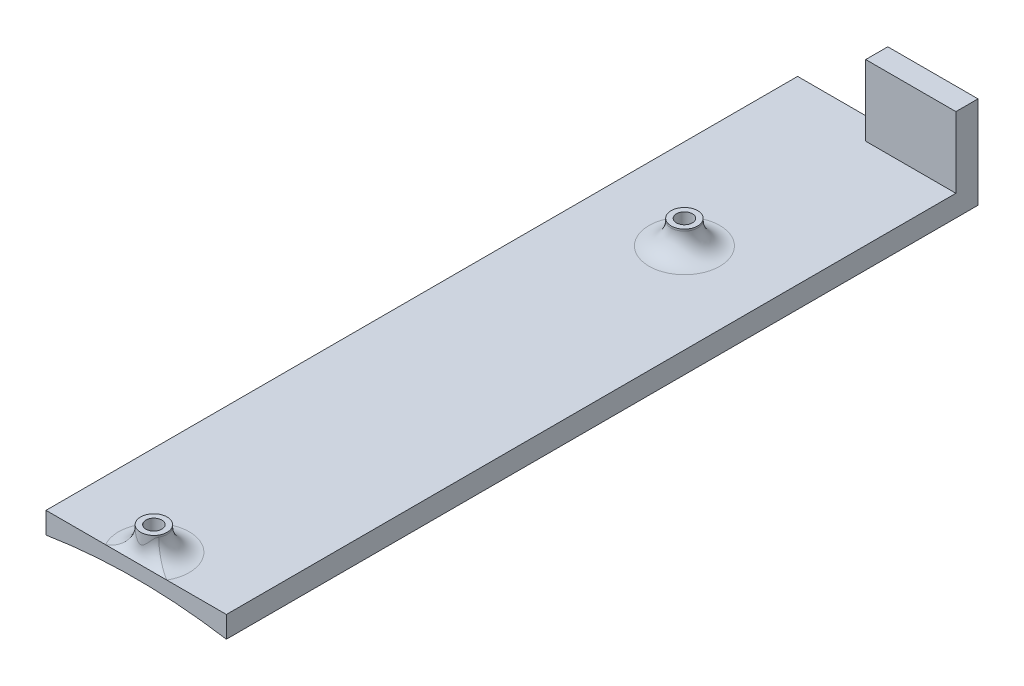
ISO-10303-21;
HEADER;
FILE_DESCRIPTION(('STEP AP214'),'2;1');
FILE_NAME('part.step','',(''),(''),'','','');
FILE_SCHEMA(('AUTOMOTIVE_DESIGN { 1 0 10303 214 1 1 1 1 }'));
ENDSEC;
DATA;
#1=APPLICATION_CONTEXT('core data for automotive mechanical design processes');
#2=APPLICATION_PROTOCOL_DEFINITION('international standard','automotive_design',2000,#1);
#3=PRODUCT_CONTEXT('',#1,'mechanical');
#4=PRODUCT('Part','Part','',(#3));
#5=PRODUCT_RELATED_PRODUCT_CATEGORY('part','',(#4));
#6=PRODUCT_DEFINITION_FORMATION('','',#4);
#7=PRODUCT_DEFINITION_CONTEXT('part definition',#1,'design');
#8=PRODUCT_DEFINITION('design','',#6,#7);
#9=PRODUCT_DEFINITION_SHAPE('','',#8);
#10=(LENGTH_UNIT() NAMED_UNIT(*) SI_UNIT(.MILLI.,.METRE.));
#11=(NAMED_UNIT(*) PLANE_ANGLE_UNIT() SI_UNIT($,.RADIAN.));
#12=(NAMED_UNIT(*) SI_UNIT($,.STERADIAN.) SOLID_ANGLE_UNIT());
#13=UNCERTAINTY_MEASURE_WITH_UNIT(LENGTH_MEASURE(1.E-05),#10,'distance_accuracy_value','');
#14=(GEOMETRIC_REPRESENTATION_CONTEXT(3) GLOBAL_UNCERTAINTY_ASSIGNED_CONTEXT((#13)) GLOBAL_UNIT_ASSIGNED_CONTEXT((#10,
#11,#12)) REPRESENTATION_CONTEXT('',''));
#15=CARTESIAN_POINT('',(0.,0.,0.));
#16=DIRECTION('',(0.,0.,1.));
#17=DIRECTION('',(1.,0.,0.));
#18=AXIS2_PLACEMENT_3D('',#15,#16,#17);
#19=CARTESIAN_POINT('',(0.,0.,21.6986827735627));
#20=DIRECTION('',(1.,0.,0.));
#21=DIRECTION('',(0.,1.,0.));
#22=AXIS2_PLACEMENT_3D('',#19,#20,#21);
#23=PLANE('',#22);
#24=DIRECTION('',(0.,0.,1.));
#25=VECTOR('',#24,1.);
#26=CARTESIAN_POINT('',(0.,-3.81000000000001,0.));
#27=LINE('',#26,#25);
#28=CARTESIAN_POINT('',(0.,-3.81000000000001,0.));
#29=VERTEX_POINT('',#28);
#30=CARTESIAN_POINT('',(0.,-3.81000000000001,3.175));
#31=VERTEX_POINT('',#30);
#32=EDGE_CURVE('E140',#29,#31,#27,.T.);
#33=ORIENTED_EDGE('',*,*,#32,.T.);
#34=DIRECTION('',(0.,1.,0.));
#35=VECTOR('',#34,1.);
#36=CARTESIAN_POINT('',(0.,0.,3.175));
#37=LINE('',#36,#35);
#38=CARTESIAN_POINT('',(0.,6.34999999999999,3.175));
#39=VERTEX_POINT('',#38);
#40=EDGE_CURVE('E72',#31,#39,#37,.T.);
#41=ORIENTED_EDGE('',*,*,#40,.T.);
#42=DIRECTION('',(0.,0.,-1.));
#43=VECTOR('',#42,1.);
#44=CARTESIAN_POINT('',(0.,6.34999999999999,21.6986827735627));
#45=LINE('',#44,#43);
#46=CARTESIAN_POINT('',(0.,6.34999999999999,0.));
#47=VERTEX_POINT('',#46);
#48=EDGE_CURVE('E151',#39,#47,#45,.T.);
#49=ORIENTED_EDGE('',*,*,#48,.T.);
#50=DIRECTION('',(0.,-1.,0.));
#51=VECTOR('',#50,1.);
#52=CARTESIAN_POINT('',(0.,0.,0.));
#53=LINE('',#52,#51);
#54=EDGE_CURVE('E67',#47,#29,#53,.T.);
#55=ORIENTED_EDGE('',*,*,#54,.T.);
#56=EDGE_LOOP('',(#33,#41,#49,#55));
#57=FACE_BOUND('',#56,.T.);
#58=ADVANCED_FACE('F41',(#57),#23,.F.);
#59=CARTESIAN_POINT('',(-12.9539999999999,-6.89087261080565,107.95));
#60=DIRECTION('',(1.,0.,0.));
#61=DIRECTION('',(0.,0.,-1.));
#62=AXIS2_PLACEMENT_3D('',#59,#60,#61);
#63=PLANE('',#62);
#64=DIRECTION('',(0.,0.,-1.));
#65=VECTOR('',#64,1.);
#66=CARTESIAN_POINT('',(-12.9539999999999,-3.81,107.95));
#67=LINE('',#66,#65);
#68=CARTESIAN_POINT('',(-12.9539999999999,-3.81,107.95));
#69=VERTEX_POINT('',#68);
#70=CARTESIAN_POINT('',(-12.9539999999999,-3.81000000000001,0.));
#71=VERTEX_POINT('',#70);
#72=EDGE_CURVE('E123',#69,#71,#67,.T.);
#73=ORIENTED_EDGE('',*,*,#72,.T.);
#74=DIRECTION('',(0.,1.,0.));
#75=VECTOR('',#74,1.);
#76=CARTESIAN_POINT('',(-12.954,-6.89087261080566,0.));
#77=LINE('',#76,#75);
#78=CARTESIAN_POINT('',(-12.954,-6.89087261080566,0.));
#79=VERTEX_POINT('',#78);
#80=EDGE_CURVE('E128',#79,#71,#77,.T.);
#81=ORIENTED_EDGE('',*,*,#80,.F.);
#82=DIRECTION('',(0.,0.,-1.));
#83=VECTOR('',#82,1.);
#84=CARTESIAN_POINT('',(-12.954,-6.89087261080566,107.95));
#85=LINE('',#84,#83);
#86=CARTESIAN_POINT('',(-12.954,-6.89087261080566,107.95));
#87=VERTEX_POINT('',#86);
#88=EDGE_CURVE('E204',#87,#79,#85,.T.);
#89=ORIENTED_EDGE('',*,*,#88,.F.);
#90=DIRECTION('',(0.,-1.,0.));
#91=VECTOR('',#90,1.);
#92=CARTESIAN_POINT('',(-12.9539999999999,-6.89087261080565,107.95));
#93=LINE('',#92,#91);
#94=EDGE_CURVE('E130',#69,#87,#93,.T.);
#95=ORIENTED_EDGE('',*,*,#94,.F.);
#96=EDGE_LOOP('',(#73,#81,#89,#95));
#97=FACE_BOUND('',#96,.T.);
#98=ADVANCED_FACE('F125',(#97),#63,.F.);
#99=CARTESIAN_POINT('',(-12.9539999999999,-3.81,107.95));
#100=DIRECTION('',(0.,-1.,0.));
#101=DIRECTION('',(1.,0.,0.));
#102=AXIS2_PLACEMENT_3D('',#99,#100,#101);
#103=PLANE('',#102);
#104=CARTESIAN_POINT('',(0.,-3.81000000000001,29.21));
#105=DIRECTION('',(0.,-1.,0.));
#106=DIRECTION('',(1.,0.,0.));
#107=AXIS2_PLACEMENT_3D('',#104,#105,#106);
#108=CIRCLE('',#107,5.08);
#109=CARTESIAN_POINT('',(5.08,-3.81000000000001,29.21));
#110=VERTEX_POINT('',#109);
#111=EDGE_CURVE('E211',#110,#110,#108,.T.);
#112=ORIENTED_EDGE('',*,*,#111,.T.);
#113=EDGE_LOOP('',(#112));
#114=FACE_BOUND('',#113,.T.);
#115=DIRECTION('',(1.,0.,0.));
#116=VECTOR('',#115,1.);
#117=CARTESIAN_POINT('',(-12.9539999999999,-3.81000000000001,3.175));
#118=LINE('',#117,#116);
#119=CARTESIAN_POINT('',(12.9540000000001,-3.81000000000001,3.175));
#120=VERTEX_POINT('',#119);
#121=EDGE_CURVE('E154',#31,#120,#118,.T.);
#122=ORIENTED_EDGE('',*,*,#121,.F.);
#123=ORIENTED_EDGE('',*,*,#32,.F.);
#124=DIRECTION('',(1.,0.,0.));
#125=VECTOR('',#124,1.);
#126=CARTESIAN_POINT('',(-12.9539999999999,-3.81000000000001,0.));
#127=LINE('',#126,#125);
#128=EDGE_CURVE('E137',#71,#29,#127,.T.);
#129=ORIENTED_EDGE('',*,*,#128,.F.);
#130=ORIENTED_EDGE('',*,*,#72,.F.);
#131=DIRECTION('',(-1.,0.,0.));
#132=VECTOR('',#131,1.);
#133=CARTESIAN_POINT('',(-12.9539999999999,-3.81,107.95));
#134=LINE('',#133,#132);
#135=CARTESIAN_POINT('',(-4.39940905122497,-3.81,107.95));
#136=VERTEX_POINT('',#135);
#137=EDGE_CURVE('E193',#136,#69,#134,.T.);
#138=ORIENTED_EDGE('',*,*,#137,.F.);
#139=CARTESIAN_POINT('',(0.,-3.81000000000001,105.41));
#140=DIRECTION('',(0.,-1.,0.));
#141=DIRECTION('',(1.,0.,0.));
#142=AXIS2_PLACEMENT_3D('',#139,#140,#141);
#143=CIRCLE('',#142,5.08000000000001);
#144=CARTESIAN_POINT('',(4.39940905122496,-3.81000000000001,107.95));
#145=VERTEX_POINT('',#144);
#146=EDGE_CURVE('E209',#136,#145,#143,.T.);
#147=ORIENTED_EDGE('',*,*,#146,.T.);
#148=CARTESIAN_POINT('',(12.9540000000001,-3.81000000000001,107.95));
#149=VERTEX_POINT('',#148);
#150=EDGE_CURVE('E134',#149,#145,#134,.T.);
#151=ORIENTED_EDGE('',*,*,#150,.F.);
#152=DIRECTION('',(0.,0.,-1.));
#153=VECTOR('',#152,1.);
#154=CARTESIAN_POINT('',(12.9540000000001,-3.81000000000001,107.95));
#155=LINE('',#154,#153);
#156=EDGE_CURVE('E133',#149,#120,#155,.T.);
#157=ORIENTED_EDGE('',*,*,#156,.T.);
#158=EDGE_LOOP('',(#122,#123,#129,#130,#138,#147,#151,#157));
#159=FACE_BOUND('',#158,.T.);
#160=ADVANCED_FACE('F139',(#114,#159),#103,.F.);
#161=CARTESIAN_POINT('',(0.,-86.36,107.95));
#162=DIRECTION('',(0.,0.,-1.));
#163=DIRECTION('',(-1.,0.,0.));
#164=AXIS2_PLACEMENT_3D('',#161,#162,#163);
#165=CYLINDRICAL_SURFACE('',#164,80.518);
#166=ORIENTED_EDGE('',*,*,#88,.T.);
#167=CARTESIAN_POINT('',(0.,-86.36,0.));
#168=DIRECTION('',(0.,0.,-1.));
#169=DIRECTION('',(1.,0.,0.));
#170=AXIS2_PLACEMENT_3D('',#167,#168,#169);
#171=CIRCLE('',#170,80.518);
#172=CARTESIAN_POINT('',(12.954,-6.89087261080566,0.));
#173=VERTEX_POINT('',#172);
#174=EDGE_CURVE('E146',#79,#173,#171,.T.);
#175=ORIENTED_EDGE('',*,*,#174,.T.);
#176=DIRECTION('',(0.,0.,-1.));
#177=VECTOR('',#176,1.);
#178=CARTESIAN_POINT('',(12.954,-6.89087261080566,107.95));
#179=LINE('',#178,#177);
#180=CARTESIAN_POINT('',(12.954,-6.89087261080566,107.95));
#181=VERTEX_POINT('',#180);
#182=EDGE_CURVE('E201',#181,#173,#179,.T.);
#183=ORIENTED_EDGE('',*,*,#182,.F.);
#184=CARTESIAN_POINT('',(0.,-86.36,107.95));
#185=DIRECTION('',(0.,0.,-1.));
#186=DIRECTION('',(1.,0.,0.));
#187=AXIS2_PLACEMENT_3D('',#184,#185,#186);
#188=CIRCLE('',#187,80.518);
#189=EDGE_CURVE('E188',#87,#181,#188,.T.);
#190=ORIENTED_EDGE('',*,*,#189,.F.);
#191=EDGE_LOOP('',(#166,#175,#183,#190));
#192=FACE_BOUND('',#191,.T.);
#193=ADVANCED_FACE('F278',(#192),#165,.F.);
#194=CARTESIAN_POINT('',(12.954,-6.89087261080566,107.95));
#195=DIRECTION('',(-1.,0.,0.));
#196=DIRECTION('',(0.,-1.,0.));
#197=AXIS2_PLACEMENT_3D('',#194,#195,#196);
#198=PLANE('',#197);
#199=DIRECTION('',(0.,1.,0.));
#200=VECTOR('',#199,1.);
#201=CARTESIAN_POINT('',(12.954,-6.89087261080566,0.));
#202=LINE('',#201,#200);
#203=CARTESIAN_POINT('',(12.954,6.35,0.));
#204=VERTEX_POINT('',#203);
#205=EDGE_CURVE('E189',#173,#204,#202,.T.);
#206=ORIENTED_EDGE('',*,*,#205,.T.);
#207=DIRECTION('',(0.,0.,-1.));
#208=VECTOR('',#207,1.);
#209=CARTESIAN_POINT('',(12.954,6.35,0.));
#210=LINE('',#209,#208);
#211=CARTESIAN_POINT('',(12.954,6.35,3.175));
#212=VERTEX_POINT('',#211);
#213=EDGE_CURVE('E157',#212,#204,#210,.T.);
#214=ORIENTED_EDGE('',*,*,#213,.F.);
#215=DIRECTION('',(0.,-1.,0.));
#216=VECTOR('',#215,1.);
#217=CARTESIAN_POINT('',(12.954,6.35,3.175));
#218=LINE('',#217,#216);
#219=EDGE_CURVE('E163',#212,#120,#218,.T.);
#220=ORIENTED_EDGE('',*,*,#219,.T.);
#221=ORIENTED_EDGE('',*,*,#156,.F.);
#222=DIRECTION('',(0.,1.,0.));
#223=VECTOR('',#222,1.);
#224=CARTESIAN_POINT('',(12.954,-6.89087261080566,107.95));
#225=LINE('',#224,#223);
#226=EDGE_CURVE('E191',#181,#149,#225,.T.);
#227=ORIENTED_EDGE('',*,*,#226,.F.);
#228=ORIENTED_EDGE('',*,*,#182,.T.);
#229=EDGE_LOOP('',(#206,#214,#220,#221,#227,#228));
#230=FACE_BOUND('',#229,.T.);
#231=ADVANCED_FACE('F346',(#230),#198,.F.);
#232=CARTESIAN_POINT('',(0.,-86.36,107.95));
#233=DIRECTION('',(0.,0.,1.));
#234=DIRECTION('',(1.,0.,0.));
#235=AXIS2_PLACEMENT_3D('',#232,#233,#234);
#236=PLANE('',#235);
#237=ORIENTED_EDGE('',*,*,#94,.T.);
#238=ORIENTED_EDGE('',*,*,#189,.T.);
#239=ORIENTED_EDGE('',*,*,#226,.T.);
#240=ORIENTED_EDGE('',*,*,#150,.T.);
#241=EDGE_CURVE('E196',#145,#136,#134,.T.);
#242=ORIENTED_EDGE('',*,*,#241,.T.);
#243=ORIENTED_EDGE('',*,*,#137,.T.);
#244=EDGE_LOOP('',(#237,#238,#239,#240,#242,#243));
#245=FACE_BOUND('',#244,.T.);
#246=ADVANCED_FACE('F240',(#245),#236,.T.);
#247=CARTESIAN_POINT('',(0.,-86.36,0.));
#248=DIRECTION('',(0.,0.,1.));
#249=DIRECTION('',(1.,0.,0.));
#250=AXIS2_PLACEMENT_3D('',#247,#248,#249);
#251=PLANE('',#250);
#252=ORIENTED_EDGE('',*,*,#174,.F.);
#253=ORIENTED_EDGE('',*,*,#80,.T.);
#254=ORIENTED_EDGE('',*,*,#128,.T.);
#255=ORIENTED_EDGE('',*,*,#54,.F.);
#256=DIRECTION('',(-1.,0.,0.));
#257=VECTOR('',#256,1.);
#258=CARTESIAN_POINT('',(-12.9539999999999,6.34999999999999,0.));
#259=LINE('',#258,#257);
#260=EDGE_CURVE('E160',#204,#47,#259,.T.);
#261=ORIENTED_EDGE('',*,*,#260,.F.);
#262=ORIENTED_EDGE('',*,*,#205,.F.);
#263=EDGE_LOOP('',(#252,#253,#254,#255,#261,#262));
#264=FACE_BOUND('',#263,.T.);
#265=ADVANCED_FACE('F144',(#264),#251,.F.);
#266=CARTESIAN_POINT('',(0.,-0.381000000000005,105.41));
#267=DIRECTION('',(0.,1.,0.));
#268=DIRECTION('',(0.,0.,1.));
#269=AXIS2_PLACEMENT_3D('',#266,#267,#268);
#270=PLANE('',#269);
#271=CARTESIAN_POINT('',(0.,-0.381000000000005,105.41));
#272=DIRECTION('',(0.,1.,0.));
#273=DIRECTION('',(0.,0.,1.));
#274=AXIS2_PLACEMENT_3D('',#271,#272,#273);
#275=CIRCLE('',#274,1.90500000000001);
#276=CARTESIAN_POINT('',(0.,-0.381000000000005,107.315));
#277=VERTEX_POINT('',#276);
#278=EDGE_CURVE('E182',#277,#277,#275,.T.);
#279=ORIENTED_EDGE('',*,*,#278,.T.);
#280=EDGE_LOOP('',(#279));
#281=FACE_BOUND('',#280,.T.);
#282=CARTESIAN_POINT('',(0.,-0.381000000000005,105.41));
#283=DIRECTION('',(0.,1.,0.));
#284=DIRECTION('',(0.,0.,1.));
#285=AXIS2_PLACEMENT_3D('',#282,#283,#284);
#286=CIRCLE('',#285,1.14300000000001);
#287=CARTESIAN_POINT('',(0.,-0.381000000000005,106.553));
#288=VERTEX_POINT('',#287);
#289=EDGE_CURVE('E179',#288,#288,#286,.T.);
#290=ORIENTED_EDGE('',*,*,#289,.F.);
#291=EDGE_LOOP('',(#290));
#292=FACE_BOUND('',#291,.T.);
#293=ADVANCED_FACE('F256',(#281,#292),#270,.T.);
#294=CARTESIAN_POINT('',(0.,-0.381000000000005,105.41));
#295=DIRECTION('',(0.,-1.,0.));
#296=DIRECTION('',(0.,0.,-1.));
#297=AXIS2_PLACEMENT_3D('',#294,#295,#296);
#298=CYLINDRICAL_SURFACE('',#297,1.90500000000001);
#299=CARTESIAN_POINT('',(0.,-0.635000000000007,105.41));
#300=DIRECTION('',(0.,-1.,0.));
#301=DIRECTION('',(1.,0.,0.));
#302=AXIS2_PLACEMENT_3D('',#299,#300,#301);
#303=CIRCLE('',#302,1.90500000000001);
#304=CARTESIAN_POINT('',(1.64977839420936,-0.635000000000008,106.3625));
#305=VERTEX_POINT('',#304);
#306=CARTESIAN_POINT('',(-1.64977839420936,-0.635000000000006,106.3625));
#307=VERTEX_POINT('',#306);
#308=EDGE_CURVE('E59',#305,#307,#303,.F.);
#309=ORIENTED_EDGE('',*,*,#308,.T.);
#310=CARTESIAN_POINT('',(-1.6721667307497,-0.636781141795463,106.322624470729));
#311=CARTESIAN_POINT('',(-1.62672221265177,-3.86174319014195,106.40589071407));
#312=CARTESIAN_POINT('',(-4.45911128199917,-3.81,107.95));
#313=CARTESIAN_POINT('',(-1.6426378772542,-0.631933074373427,106.376801824383));
#314=CARTESIAN_POINT('',(-1.6581385834826,-3.79399145201548,106.34183119343));
#315=CARTESIAN_POINT('',(-4.38036767267771,-3.81,107.95));
#316=CARTESIAN_POINT('',(-1.61045257029352,-0.637097567066024,106.429446827609));
#317=CARTESIAN_POINT('',(-1.68880160248517,-3.71933595294472,106.299689223068));
#318=CARTESIAN_POINT('',(-4.29454018744931,-3.81,107.95));
#319=CARTESIAN_POINT('',(-1.54167862987858,-0.663935327663639,106.530686228705));
#320=CARTESIAN_POINT('',(-1.73878159048373,-3.57046595957785,106.254383468216));
#321=CARTESIAN_POINT('',(-4.1111430130096,-3.81,107.95));
#322=CARTESIAN_POINT('',(-1.50511909939597,-0.685504093832294,106.579304115463));
#323=CARTESIAN_POINT('',(-1.7583474954536,-3.49652620564305,106.250119818719));
#324=CARTESIAN_POINT('',(-4.01365093172268,-3.81,107.95));
#325=CARTESIAN_POINT('',(-1.40652140528111,-0.757407581800887,106.698256693042));
#326=CARTESIAN_POINT('',(-1.78478251676544,-3.32234496053901,106.277710531567));
#327=CARTESIAN_POINT('',(-3.75072374741607,-3.81,107.95));
#328=CARTESIAN_POINT('',(-1.34169365236754,-0.817091235243672,106.765477937348));
#329=CARTESIAN_POINT('',(-1.78010537994981,-3.22801272566746,106.32901816598));
#330=CARTESIAN_POINT('',(-3.57784973964593,-3.81,107.95));
#331=CARTESIAN_POINT('',(-1.20453374850763,-0.956340623773255,106.888746194415));
#332=CARTESIAN_POINT('',(-1.72201308757156,-3.07958191774923,106.464790659879));
#333=CARTESIAN_POINT('',(-3.21208999602116,-3.81,107.95));
#334=CARTESIAN_POINT('',(-1.13216969568859,-1.03599306868141,106.94474250562));
#335=CARTESIAN_POINT('',(-1.67018877285162,-3.02393928713444,106.548286365923));
#336=CARTESIAN_POINT('',(-3.01911918850605,-3.81,107.95));
#337=CARTESIAN_POINT('',(-0.979088929168684,-1.20670905368073,107.046801943812));
#338=CARTESIAN_POINT('',(-1.5234502826278,-2.94719886752978,106.721425707388));
#339=CARTESIAN_POINT('',(-2.61090381111323,-3.81,107.95));
#340=CARTESIAN_POINT('',(-0.898191153766391,-1.2980360258347,107.092530888712));
#341=CARTESIAN_POINT('',(-1.42834220321079,-2.92565420382507,106.811568641812));
#342=CARTESIAN_POINT('',(-2.39517641003139,-3.81,107.95));
#343=CARTESIAN_POINT('',(-0.772280670179447,-1.43251870609355,107.15205534709));
#344=CARTESIAN_POINT('',(-1.25924154435489,-2.91200697117103,106.936668204781));
#345=CARTESIAN_POINT('',(-2.05941512048467,-3.81,107.95));
#346=CARTESIAN_POINT('',(-0.729545985912474,-1.47693202907554,107.17038653098));
#347=CARTESIAN_POINT('',(-1.19907613407569,-2.91047401962154,106.976438734011));
#348=CARTESIAN_POINT('',(-1.94545596245091,-3.81,107.95));
#349=CARTESIAN_POINT('',(-0.642518603547036,-1.56296912930079,107.203982437055));
#350=CARTESIAN_POINT('',(-1.07136634960724,-2.91168679846818,107.050988824646));
#351=CARTESIAN_POINT('',(-1.71338294280331,-3.81,107.95));
#352=CARTESIAN_POINT('',(-0.598226303321815,-1.60459361113846,107.219247935741));
#353=CARTESIAN_POINT('',(-1.00379055456577,-2.91438306891922,107.085896662835));
#354=CARTESIAN_POINT('',(-1.59527014218478,-3.81,107.95));
#355=CARTESIAN_POINT('',(-0.485296610062094,-1.70249288969612,107.253509334112));
#356=CARTESIAN_POINT('',(-0.826771116847523,-2.92414327469882,107.165192092062));
#357=CARTESIAN_POINT('',(-1.29412429350901,-3.81,107.95));
#358=CARTESIAN_POINT('',(-0.41561910813807,-1.75560660857147,107.27051982188));
#359=CARTESIAN_POINT('',(-0.712490724412666,-2.93271658465898,107.206149139234));
#360=CARTESIAN_POINT('',(-1.1083176217774,-3.81000000000001,107.95));
#361=CARTESIAN_POINT('',(-0.308829813308879,-1.81950609474379,107.290147536739));
#362=CARTESIAN_POINT('',(-0.532873954867028,-2.94466210805277,107.25382603379));
#363=CARTESIAN_POINT('',(-0.823546168869155,-3.81000000000001,107.95));
#364=CARTESIAN_POINT('',(-0.272904035988847,-1.83816296537389,107.29570526032));
#365=CARTESIAN_POINT('',(-0.471828969012712,-2.94848353115007,107.267426799026));
#366=CARTESIAN_POINT('',(-0.727744095984212,-3.81000000000001,107.95));
#367=CARTESIAN_POINT('',(-0.200421401257377,-1.86909139612613,107.304779236708));
#368=CARTESIAN_POINT('',(-0.347754616378425,-2.95507682484346,107.289694684979));
#369=CARTESIAN_POINT('',(-0.534457070009536,-3.81000000000001,107.95));
#370=CARTESIAN_POINT('',(-0.163864930008816,-1.88136672955633,107.308296696037));
#371=CARTESIAN_POINT('',(-0.284645720477662,-2.95785725808991,107.298395939584));
#372=CARTESIAN_POINT('',(-0.436973146687453,-3.81000000000001,107.95));
#373=CARTESIAN_POINT('',(-0.0899570571916948,-1.89872264373107,107.313239119362));
#374=CARTESIAN_POINT('',(-0.156606116966008,-2.96184069330533,107.310622359969));
#375=CARTESIAN_POINT('',(-0.239885485847286,-3.81000000000001,107.95));
#376=CARTESIAN_POINT('',(-0.0526013353932421,-1.90372215973685,107.314640513228));
#377=CARTESIAN_POINT('',(-0.0915669922487007,-2.96303177591255,107.314107811576));
#378=CARTESIAN_POINT('',(-0.140270227716055,-3.81000000000001,107.95));
#379=CARTESIAN_POINT('',(0.0221581877923277,-1.90584541863746,107.315237859472));
#380=CARTESIAN_POINT('',(0.0385609629344973,-2.9635327566232,107.315590224287));
#381=CARTESIAN_POINT('',(0.0590885007802838,-3.81000000000001,107.95));
#382=CARTESIAN_POINT('',(0.0595619870204116,-1.90296950364097,107.314433907649));
#383=CARTESIAN_POINT('',(0.103750270299668,-2.96284351665257,107.313589716159));
#384=CARTESIAN_POINT('',(0.158831965387969,-3.81000000000001,107.95));
#385=CARTESIAN_POINT('',(0.134143791226946,-1.88957377704065,107.310638769483));
#386=CARTESIAN_POINT('',(0.233217704341419,-2.95973229571332,107.304188010076));
#387=CARTESIAN_POINT('',(0.357716776604986,-3.81000000000001,107.95));
#388=CARTESIAN_POINT('',(0.171321123490097,-1.87903726194991,107.307642803492));
#389=CARTESIAN_POINT('',(0.297591342923249,-2.95730183173107,107.296760597189));
#390=CARTESIAN_POINT('',(0.456856329306856,-3.81000000000001,107.95));
#391=CARTESIAN_POINT('',(0.245071550784232,-1.85114005519225,107.299535188327));
#392=CARTESIAN_POINT('',(0.424328565569755,-2.95120773207034,107.276816760704));
#393=CARTESIAN_POINT('',(0.653524135425803,-3.81000000000001,107.95));
#394=CARTESIAN_POINT('',(0.281644501044933,-1.83377775251343,107.294423039679));
#395=CARTESIAN_POINT('',(0.486779217673829,-2.94753580895551,107.264269967243));
#396=CARTESIAN_POINT('',(0.751052002788792,-3.81000000000001,107.95));
#397=CARTESIAN_POINT('',(0.410335899595679,-1.76197687548871,107.272645140225));
#398=CARTESIAN_POINT('',(0.704664379572565,-2.93355757781501,107.211099581131));
#399=CARTESIAN_POINT('',(1.09422906558258,-3.81000000000001,107.95));
#400=CARTESIAN_POINT('',(0.500335031580809,-1.69188412568509,107.250379193439));
#401=CARTESIAN_POINT('',(0.852567890893547,-2.92184531255282,107.157106922246));
#402=CARTESIAN_POINT('',(1.33422675084797,-3.81000000000001,107.95));
#403=CARTESIAN_POINT('',(0.630692405949074,-1.57432567338336,107.208154040705));
#404=CARTESIAN_POINT('',(1.05337735904978,-2.91240650717113,107.060598440984));
#405=CARTESIAN_POINT('',(1.68184641588135,-3.81000000000001,107.95));
#406=CARTESIAN_POINT('',(0.673449609267601,-1.53297741058787,107.192569143672));
#407=CARTESIAN_POINT('',(1.1174976764659,-2.9106259877229,107.025354537389));
#408=CARTESIAN_POINT('',(1.79586562476366,-3.81000000000001,107.95));
#409=CARTESIAN_POINT('',(0.757490211399576,-1.44807850812966,107.158508769854));
#410=CARTESIAN_POINT('',(1.23850767634215,-2.91139969181848,106.950696416211));
#411=CARTESIAN_POINT('',(2.01997389703614,-3.81000000000001,107.95));
#412=CARTESIAN_POINT('',(0.79877381768524,-1.40452818060543,107.140033701972));
#413=CARTESIAN_POINT('',(1.29541925676998,-2.91400601123682,106.911166326001));
#414=CARTESIAN_POINT('',(2.13006351368558,-3.81000000000001,107.95));
#415=CARTESIAN_POINT('',(0.925550235784951,-1.26769186808409,107.077820869673));
#416=CARTESIAN_POINT('',(1.46193379724997,-2.93160447304869,106.782227201281));
#417=CARTESIAN_POINT('',(2.46813396239442,-3.81000000000001,107.95));
#418=CARTESIAN_POINT('',(1.00850676538122,-1.17359353314896,107.029052474708));
#419=CARTESIAN_POINT('',(1.55578940821796,-2.95762924756306,106.688104242801));
#420=CARTESIAN_POINT('',(2.68935137610007,-3.81000000000001,107.95));
#421=CARTESIAN_POINT('',(1.16721983354834,-0.997373538975048,106.918616609226));
#422=CARTESIAN_POINT('',(1.69782287562092,-3.04831926542739,106.508236184115));
#423=CARTESIAN_POINT('',(3.11258622460347,-3.81000000000001,107.95));
#424=CARTESIAN_POINT('',(1.24298894318784,-0.915230829173272,106.856972287519));
#425=CARTESIAN_POINT('',(1.74471873103094,-3.11466315716106,106.422292756421));
#426=CARTESIAN_POINT('',(3.31463718225601,-3.81000000000001,107.95));
#427=CARTESIAN_POINT('',(1.36877305795726,-0.792579540523785,106.737077052416));
#428=CARTESIAN_POINT('',(1.78171729825631,-3.26700610941627,106.30899022678));
#429=CARTESIAN_POINT('',(3.65006148756473,-3.81000000000001,107.95));
#430=CARTESIAN_POINT('',(1.4206226950274,-0.746814206322238,106.681517775712));
#431=CARTESIAN_POINT('',(1.78167910087651,-3.34614274487636,106.273030897672));
#432=CARTESIAN_POINT('',(3.78832718665669,-3.81000000000001,107.95));
#433=CARTESIAN_POINT('',(1.51798362796123,-0.676448534338228,106.563496273659));
#434=CARTESIAN_POINT('',(1.75414292069047,-3.52058325598366,106.247289412378));
#435=CARTESIAN_POINT('',(4.0479563413127,-3.81000000000001,107.95));
#436=CARTESIAN_POINT('',(1.56351527698552,-0.651778846008309,106.501057434631));
#437=CARTESIAN_POINT('',(1.72581677944524,-3.6162022770135,106.258978430489));
#438=CARTESIAN_POINT('',(4.1693740719727,-3.81000000000001,107.95));
#439=CARTESIAN_POINT('',(1.61696553024241,-0.637996122668489,106.417438775093));
#440=CARTESIAN_POINT('',(1.68110670603674,-3.73474434364676,106.313653107523));
#441=CARTESIAN_POINT('',(4.31190808064321,-3.81000000000001,107.95));
#442=CARTESIAN_POINT('',(1.62845945639952,-0.63607148089369,106.398750780679));
#443=CARTESIAN_POINT('',(1.67055882331004,-3.76099351370894,106.328472445445));
#444=CARTESIAN_POINT('',(4.34255855039711,-3.81000000000001,107.95));
#445=CARTESIAN_POINT('',(1.6508035471498,-0.634603743239718,106.360974496926));
#446=CARTESIAN_POINT('',(1.64889383887255,-3.8124243982547,106.363301618492));
#447=CARTESIAN_POINT('',(4.40214279240109,-3.81000000000001,107.95));
#448=CARTESIAN_POINT('',(1.66165353638759,-0.635061293091001,106.341886100449));
#449=CARTESIAN_POINT('',(1.63777921915674,-3.8375796565344,106.383343813134));
#450=CARTESIAN_POINT('',(4.43107609703681,-3.81000000000001,107.95));
#451=CARTESIAN_POINT('',(1.67216904495995,-0.636781520725133,106.322620230478));
#452=CARTESIAN_POINT('',(1.62671976732461,-3.86174853156033,106.405895696701));
#453=CARTESIAN_POINT('',(4.45911745322652,-3.81000000000001,107.95));
#454=(BOUNDED_SURFACE() B_SPLINE_SURFACE(3,2,((#310,#311,#312),(#313,#314,#315),(#316,#317,
#318),(#319,#320,#321),(#322,#323,#324),(#325,#326,#327),(#328,#329,#330),(#331,#332,#333),
(#334,#335,#336),(#337,#338,#339),(#340,#341,#342),(#343,#344,#345),(#346,#347,#348),(#349,#350,
#351),(#352,#353,#354),(#355,#356,#357),(#358,#359,#360),(#361,#362,#363),(#364,#365,#366),
(#367,#368,#369),(#370,#371,#372),(#373,#374,#375),(#376,#377,#378),(#379,#380,#381),(#382,#383,
#384),(#385,#386,#387),(#388,#389,#390),(#391,#392,#393),(#394,#395,#396),(#397,#398,#399),
(#400,#401,#402),(#403,#404,#405),(#406,#407,#408),(#409,#410,#411),(#412,#413,#414),(#415,#416,
#417),(#418,#419,#420),(#421,#422,#423),(#424,#425,#426),(#427,#428,#429),(#430,#431,#432),
(#433,#434,#435),(#436,#437,#438),(#439,#440,#441),(#442,#443,#444),(#445,#446,#447),(#448,#449,
#450),(#451,#452,#453)),.UNSPECIFIED.,.F.,.F.,.F.) B_SPLINE_SURFACE_WITH_KNOTS((4,2,2,2,2,2,2,2,
2,2,2,2,2,2,2,2,2,2,2,2,2,2,2,4),(3,3),(0.,0.492587638547532,0.982063312191497,1.74606779241144,
2.5134490549671,3.30302770045169,3.69788520471238,4.09264256997516,4.68594574509058,
4.98180803777507,5.27749519194155,5.57645221875857,5.87539625908975,6.17499409162082,
6.47466267726329,7.24061570937871,7.62508473835002,8.00949942151156,8.82655487524659,
9.64215384918136,10.2634051110963,10.8826061115217,11.058155430943,11.2337523382416),(0.,1.),
.UNSPECIFIED.) GEOMETRIC_REPRESENTATION_ITEM() RATIONAL_B_SPLINE_SURFACE(((1.,0.701411224298554,
1.),(1.,0.70883993644932,1.),(1.,0.717328011463435,1.),(1.,0.735576447878796,1.),(1.,
0.745328432725857,1.),(1.,0.77099284778507,1.),(1.,0.787292788161053,1.),(1.,0.819122521383074,
1.),(1.,0.83464859187544,1.),(1.,0.864028922951749,1.),(1.,0.877821833513003,1.),(1.,
0.896193876200888,1.),(1.,0.901932065217861,1.),(1.,0.912551502644564,1.),(1.,0.917432968012173,
1.),(1.,0.928466190241666,1.),(1.,0.934022007155246,1.),(1.,0.94046616505741,1.),(1.,
0.942298098151946,1.),(1.,0.945294855290109,1.),(1.,0.946460073593389,1.),(1.,0.948098517150249,
1.),(1.,0.948563947464189,1.),(1.,0.948762268795054,1.),(1.,0.948495191632099,1.),(1.,
0.947236250583026,1.),(1.,0.946242802861932,1.),(1.,0.943562129145571,1.),(1.,0.941874739362832,
1.),(1.,0.934711605036063,1.),(1.,0.927426581253463,1.),(1.,0.913886970936059,1.),(1.,
0.908926261885526,1.),(1.,0.898212958878922,1.),(1.,0.892460476957194,1.),(1.,0.873364829634933,
1.),(1.,0.858765057634236,1.),(1.,0.827356006643319,1.),(1.,0.810550712704411,1.),(1.,
0.780487426178288,1.),(1.,0.767338379957155,1.),(1.,0.741962812807396,1.),(1.,0.729733390560408,
1.),(1.,0.715636414612068,1.),(1.,0.712622760605671,1.),(1.,0.706830872331998,1.),(1.,
0.704052702103718,1.),(1.,0.701410642762945,1.))) REPRESENTATION_ITEM('') SURFACE());
#455=CARTESIAN_POINT('',(-1.6721667307497,-0.636781141795463,106.322624470729));
#456=CARTESIAN_POINT('',(-1.6426378772542,-0.631933074373427,106.376801824383));
#457=CARTESIAN_POINT('',(-1.61045257029352,-0.637097567066024,106.429446827609));
#458=CARTESIAN_POINT('',(-1.54167862987858,-0.663935327663639,106.530686228705));
#459=CARTESIAN_POINT('',(-1.50511909939597,-0.685504093832294,106.579304115463));
#460=CARTESIAN_POINT('',(-1.4065214052811,-0.757407581800887,106.698256693042));
#461=CARTESIAN_POINT('',(-1.34169365236754,-0.817091235243672,106.765477937348));
#462=CARTESIAN_POINT('',(-1.20453374850763,-0.956340623773255,106.888746194415));
#463=CARTESIAN_POINT('',(-1.13216969568859,-1.03599306868141,106.94474250562));
#464=CARTESIAN_POINT('',(-0.979088929168684,-1.20670905368073,107.046801943812));
#465=CARTESIAN_POINT('',(-0.898191153766391,-1.2980360258347,107.092530888712));
#466=CARTESIAN_POINT('',(-0.772280670179447,-1.43251870609355,107.15205534709));
#467=CARTESIAN_POINT('',(-0.729545985912474,-1.47693202907554,107.17038653098));
#468=CARTESIAN_POINT('',(-0.642518603547036,-1.56296912930079,107.203982437055));
#469=CARTESIAN_POINT('',(-0.598226303321815,-1.60459361113846,107.219247935741));
#470=CARTESIAN_POINT('',(-0.485296610062094,-1.70249288969612,107.253509334112));
#471=CARTESIAN_POINT('',(-0.41561910813807,-1.75560660857147,107.27051982188));
#472=CARTESIAN_POINT('',(-0.308829813308879,-1.81950609474379,107.290147536739));
#473=CARTESIAN_POINT('',(-0.272904035988847,-1.83816296537389,107.29570526032));
#474=CARTESIAN_POINT('',(-0.200421401257377,-1.86909139612613,107.304779236708));
#475=CARTESIAN_POINT('',(-0.163864930008816,-1.88136672955633,107.308296696037));
#476=CARTESIAN_POINT('',(-0.0899570571916947,-1.89872264373107,107.313239119362));
#477=CARTESIAN_POINT('',(-0.0526013353932421,-1.90372215973685,107.314640513228));
#478=CARTESIAN_POINT('',(0.0221581877923277,-1.90584541863746,107.315237859472));
#479=CARTESIAN_POINT('',(0.0595619870204116,-1.90296950364097,107.314433907649));
#480=CARTESIAN_POINT('',(0.134143791226946,-1.88957377704065,107.310638769483));
#481=CARTESIAN_POINT('',(0.171321123490097,-1.87903726194991,107.307642803492));
#482=CARTESIAN_POINT('',(0.245071550784232,-1.85114005519225,107.299535188327));
#483=CARTESIAN_POINT('',(0.281644501044933,-1.83377775251343,107.294423039679));
#484=CARTESIAN_POINT('',(0.410335899595679,-1.76197687548871,107.272645140225));
#485=CARTESIAN_POINT('',(0.500335031580809,-1.69188412568509,107.250379193439));
#486=CARTESIAN_POINT('',(0.630692405949074,-1.57432567338336,107.208154040705));
#487=CARTESIAN_POINT('',(0.673449609267601,-1.53297741058787,107.192569143672));
#488=CARTESIAN_POINT('',(0.757490211399576,-1.44807850812966,107.158508769854));
#489=CARTESIAN_POINT('',(0.79877381768524,-1.40452818060543,107.140033701972));
#490=CARTESIAN_POINT('',(0.925550235784951,-1.26769186808409,107.077820869673));
#491=CARTESIAN_POINT('',(1.00850676538122,-1.17359353314896,107.029052474708));
#492=CARTESIAN_POINT('',(1.16721983354834,-0.997373538975048,106.918616609226));
#493=CARTESIAN_POINT('',(1.24298894318784,-0.915230829173272,106.856972287519));
#494=CARTESIAN_POINT('',(1.36877305795726,-0.792579540523785,106.737077052416));
#495=CARTESIAN_POINT('',(1.4206226950274,-0.746814206322238,106.681517775712));
#496=CARTESIAN_POINT('',(1.51798362796123,-0.676448534338228,106.563496273659));
#497=CARTESIAN_POINT('',(1.56351527698552,-0.651778846008308,106.501057434631));
#498=CARTESIAN_POINT('',(1.61696553024241,-0.637996122668489,106.417438775093));
#499=CARTESIAN_POINT('',(1.62845945639952,-0.63607148089369,106.398750780679));
#500=CARTESIAN_POINT('',(1.6508035471498,-0.634603743239719,106.360974496926));
#501=CARTESIAN_POINT('',(1.66165353638759,-0.635061293091001,106.341886100449));
#502=CARTESIAN_POINT('',(1.67216904495995,-0.636781520725133,106.322620230478));
#503=B_SPLINE_CURVE_WITH_KNOTS('',3,(#455,#456,#457,#458,#459,#460,#461,#462,#463,#464,#465,
#466,#467,#468,#469,#470,#471,#472,#473,#474,#475,#476,#477,#478,#479,#480,#481,#482,#483,#484,
#485,#486,#487,#488,#489,#490,#491,#492,#493,#494,#495,#496,#497,#498,#499,#500,#501,#502),
.UNSPECIFIED.,.F.,.F.,(4,2,2,2,2,2,2,2,2,2,2,2,2,2,2,2,2,2,2,2,2,2,2,4),(0.,0.492587638547532,
0.982063312191497,1.74606779241144,2.5134490549671,3.30302770045169,3.69788520471238,
4.09264256997516,4.68594574509058,4.98180803777507,5.27749519194155,5.57645221875857,
5.87539625908975,6.17499409162082,6.47466267726329,7.24061570937871,7.62508473835002,
8.00949942151156,8.82655487524659,9.64215384918136,10.2634051110963,10.8826061115217,
11.058155430943,11.2337523382416),.UNSPECIFIED.);
#504=EDGE_CURVE('E11',#307,#305,#503,.T.);
#505=ORIENTED_EDGE('',*,*,#504,.T.);
#506=EDGE_LOOP('',(#309,#505));
#507=FACE_BOUND('',#506,.T.);
#508=ORIENTED_EDGE('',*,*,#278,.F.);
#509=EDGE_LOOP('',(#508));
#510=FACE_BOUND('',#509,.T.);
#511=ADVANCED_FACE('F221',(#507,#510),#298,.T.);
#512=CARTESIAN_POINT('',(0.,-0.381000000000005,105.41));
#513=DIRECTION('',(0.,-1.,0.));
#514=DIRECTION('',(0.,0.,-1.));
#515=AXIS2_PLACEMENT_3D('',#512,#513,#514);
#516=CYLINDRICAL_SURFACE('',#515,1.14300000000001);
#517=ORIENTED_EDGE('',*,*,#289,.T.);
#518=EDGE_LOOP('',(#517));
#519=FACE_BOUND('',#518,.T.);
#520=CARTESIAN_POINT('',(0.,-3.81000000000001,105.41));
#521=DIRECTION('',(0.,1.,0.));
#522=DIRECTION('',(0.,0.,1.));
#523=AXIS2_PLACEMENT_3D('',#520,#521,#522);
#524=CIRCLE('',#523,1.14300000000001);
#525=CARTESIAN_POINT('',(0.,-3.81000000000001,106.553));
#526=VERTEX_POINT('',#525);
#527=EDGE_CURVE('E176',#526,#526,#524,.T.);
#528=ORIENTED_EDGE('',*,*,#527,.F.);
#529=EDGE_LOOP('',(#528));
#530=FACE_BOUND('',#529,.T.);
#531=ADVANCED_FACE('F255',(#519,#530),#516,.F.);
#532=ORIENTED_EDGE('',*,*,#527,.T.);
#533=EDGE_LOOP('',(#532));
#534=FACE_BOUND('',#533,.T.);
#535=ADVANCED_FACE('F265',(#534),#103,.F.);
#536=CARTESIAN_POINT('',(0.,-0.381000000000005,29.21));
#537=DIRECTION('',(0.,1.,0.));
#538=DIRECTION('',(0.,0.,1.));
#539=AXIS2_PLACEMENT_3D('',#536,#537,#538);
#540=PLANE('',#539);
#541=CARTESIAN_POINT('',(0.,-0.381000000000005,29.21));
#542=DIRECTION('',(0.,1.,0.));
#543=DIRECTION('',(0.,0.,1.));
#544=AXIS2_PLACEMENT_3D('',#541,#542,#543);
#545=CIRCLE('',#544,1.905);
#546=CARTESIAN_POINT('',(0.,-0.381000000000005,31.115));
#547=VERTEX_POINT('',#546);
#548=EDGE_CURVE('E168',#547,#547,#545,.T.);
#549=ORIENTED_EDGE('',*,*,#548,.T.);
#550=EDGE_LOOP('',(#549));
#551=FACE_BOUND('',#550,.T.);
#552=CARTESIAN_POINT('',(0.,-0.381000000000005,29.21));
#553=DIRECTION('',(0.,1.,0.));
#554=DIRECTION('',(0.,0.,1.));
#555=AXIS2_PLACEMENT_3D('',#552,#553,#554);
#556=CIRCLE('',#555,1.143);
#557=CARTESIAN_POINT('',(0.,-0.381000000000005,30.353));
#558=VERTEX_POINT('',#557);
#559=EDGE_CURVE('E171',#558,#558,#556,.T.);
#560=ORIENTED_EDGE('',*,*,#559,.F.);
#561=EDGE_LOOP('',(#560));
#562=FACE_BOUND('',#561,.T.);
#563=ADVANCED_FACE('F270',(#551,#562),#540,.T.);
#564=CARTESIAN_POINT('',(0.,-0.381000000000005,29.21));
#565=DIRECTION('',(0.,-1.,0.));
#566=DIRECTION('',(0.,0.,-1.));
#567=AXIS2_PLACEMENT_3D('',#564,#565,#566);
#568=CYLINDRICAL_SURFACE('',#567,1.905);
#569=CARTESIAN_POINT('',(0.,-0.635000000000007,29.21));
#570=DIRECTION('',(0.,-1.,0.));
#571=DIRECTION('',(1.,0.,0.));
#572=AXIS2_PLACEMENT_3D('',#569,#570,#571);
#573=CIRCLE('',#572,1.905);
#574=CARTESIAN_POINT('',(1.905,-0.635000000000008,29.21));
#575=VERTEX_POINT('',#574);
#576=EDGE_CURVE('E206',#575,#575,#573,.F.);
#577=ORIENTED_EDGE('',*,*,#576,.T.);
#578=EDGE_LOOP('',(#577));
#579=FACE_BOUND('',#578,.T.);
#580=ORIENTED_EDGE('',*,*,#548,.F.);
#581=EDGE_LOOP('',(#580));
#582=FACE_BOUND('',#581,.T.);
#583=ADVANCED_FACE('F274',(#579,#582),#568,.T.);
#584=CARTESIAN_POINT('',(0.,-0.381000000000005,29.21));
#585=DIRECTION('',(0.,-1.,0.));
#586=DIRECTION('',(0.,0.,-1.));
#587=AXIS2_PLACEMENT_3D('',#584,#585,#586);
#588=CYLINDRICAL_SURFACE('',#587,1.143);
#589=ORIENTED_EDGE('',*,*,#559,.T.);
#590=EDGE_LOOP('',(#589));
#591=FACE_BOUND('',#590,.T.);
#592=CARTESIAN_POINT('',(0.,-3.81000000000001,29.21));
#593=DIRECTION('',(0.,1.,0.));
#594=DIRECTION('',(0.,0.,1.));
#595=AXIS2_PLACEMENT_3D('',#592,#593,#594);
#596=CIRCLE('',#595,1.143);
#597=CARTESIAN_POINT('',(0.,-3.81000000000001,30.353));
#598=VERTEX_POINT('',#597);
#599=EDGE_CURVE('E173',#598,#598,#596,.T.);
#600=ORIENTED_EDGE('',*,*,#599,.F.);
#601=EDGE_LOOP('',(#600));
#602=FACE_BOUND('',#601,.T.);
#603=ADVANCED_FACE('F281',(#591,#602),#588,.F.);
#604=ORIENTED_EDGE('',*,*,#599,.T.);
#605=EDGE_LOOP('',(#604));
#606=FACE_BOUND('',#605,.T.);
#607=ADVANCED_FACE('F232',(#606),#103,.F.);
#608=CARTESIAN_POINT('',(0.,-0.635000000000006,29.21));
#609=DIRECTION('',(0.,-1.,0.));
#610=DIRECTION('',(1.,0.,0.));
#611=AXIS2_PLACEMENT_3D('',#608,#609,#610);
#612=TOROIDAL_SURFACE('',#611,5.08,3.175);
#613=ORIENTED_EDGE('',*,*,#111,.F.);
#614=EDGE_LOOP('',(#613));
#615=FACE_BOUND('',#614,.T.);
#616=ORIENTED_EDGE('',*,*,#576,.F.);
#617=EDGE_LOOP('',(#616));
#618=FACE_BOUND('',#617,.T.);
#619=ADVANCED_FACE('F229',(#615,#618),#612,.F.);
#620=CARTESIAN_POINT('',(0.,-0.635000000000006,105.41));
#621=DIRECTION('',(0.,-1.,0.));
#622=DIRECTION('',(1.,0.,0.));
#623=AXIS2_PLACEMENT_3D('',#620,#621,#622);
#624=TOROIDAL_SURFACE('',#623,5.08000000000001,3.175);
#625=CARTESIAN_POINT('',(4.39940905122496,-0.635000000000008,107.95));
#626=DIRECTION('',(0.499999999999997,0.,-0.86602540378444));
#627=DIRECTION('',(-0.86602540378444,0.,-0.499999999999997));
#628=AXIS2_PLACEMENT_3D('',#625,#626,#627);
#629=CIRCLE('',#628,3.175);
#630=EDGE_CURVE('E167',#145,#305,#629,.T.);
#631=ORIENTED_EDGE('',*,*,#630,.F.);
#632=ORIENTED_EDGE('',*,*,#146,.F.);
#633=CARTESIAN_POINT('',(-4.39940905122495,-0.635000000000006,107.95));
#634=DIRECTION('',(-0.500000000000002,0.,-0.866025403784438));
#635=DIRECTION('',(-0.866025403784438,0.,0.500000000000002));
#636=AXIS2_PLACEMENT_3D('',#633,#634,#635);
#637=CIRCLE('',#636,3.175);
#638=EDGE_CURVE('E172',#307,#136,#637,.T.);
#639=ORIENTED_EDGE('',*,*,#638,.F.);
#640=ORIENTED_EDGE('',*,*,#308,.F.);
#641=EDGE_LOOP('',(#631,#632,#639,#640));
#642=FACE_BOUND('',#641,.T.);
#643=ADVANCED_FACE('F231',(#642),#624,.F.);
#644=ORIENTED_EDGE('',*,*,#638,.T.);
#645=ORIENTED_EDGE('',*,*,#241,.F.);
#646=ORIENTED_EDGE('',*,*,#630,.T.);
#647=ORIENTED_EDGE('',*,*,#504,.F.);
#648=EDGE_LOOP('',(#644,#645,#646,#647));
#649=FACE_BOUND('',#648,.T.);
#650=ADVANCED_FACE('F43',(#649),#454,.F.);
#651=CARTESIAN_POINT('',(-12.9539999999999,6.34999999999999,3.175));
#652=DIRECTION('',(0.,0.,-1.));
#653=DIRECTION('',(-1.,0.,0.));
#654=AXIS2_PLACEMENT_3D('',#651,#652,#653);
#655=PLANE('',#654);
#656=DIRECTION('',(1.,0.,0.));
#657=VECTOR('',#656,1.);
#658=CARTESIAN_POINT('',(-12.9539999999999,6.34999999999999,3.175));
#659=LINE('',#658,#657);
#660=EDGE_CURVE('E155',#39,#212,#659,.T.);
#661=ORIENTED_EDGE('',*,*,#660,.F.);
#662=ORIENTED_EDGE('',*,*,#40,.F.);
#663=ORIENTED_EDGE('',*,*,#121,.T.);
#664=ORIENTED_EDGE('',*,*,#219,.F.);
#665=EDGE_LOOP('',(#661,#662,#663,#664));
#666=FACE_BOUND('',#665,.T.);
#667=ADVANCED_FACE('F292',(#666),#655,.F.);
#668=CARTESIAN_POINT('',(0.,6.34999999999999,0.));
#669=DIRECTION('',(0.,1.,0.));
#670=DIRECTION('',(-1.,0.,0.));
#671=AXIS2_PLACEMENT_3D('',#668,#669,#670);
#672=PLANE('',#671);
#673=ORIENTED_EDGE('',*,*,#48,.F.);
#674=ORIENTED_EDGE('',*,*,#660,.T.);
#675=ORIENTED_EDGE('',*,*,#213,.T.);
#676=ORIENTED_EDGE('',*,*,#260,.T.);
#677=EDGE_LOOP('',(#673,#674,#675,#676));
#678=FACE_BOUND('',#677,.T.);
#679=ADVANCED_FACE('F289',(#678),#672,.T.);
#680=CLOSED_SHELL('',(#58,#98,#160,#193,#231,#246,#265,#293,#511,#531,#535,#563,#583,#603,#607,
#619,#643,#650,#667,#679));
#681=MANIFOLD_SOLID_BREP('B2',#680);
#682=ADVANCED_BREP_SHAPE_REPRESENTATION('',(#18,#681),#14);
#683=SHAPE_DEFINITION_REPRESENTATION(#9,#682);
ENDSEC;
END-ISO-10303-21;
